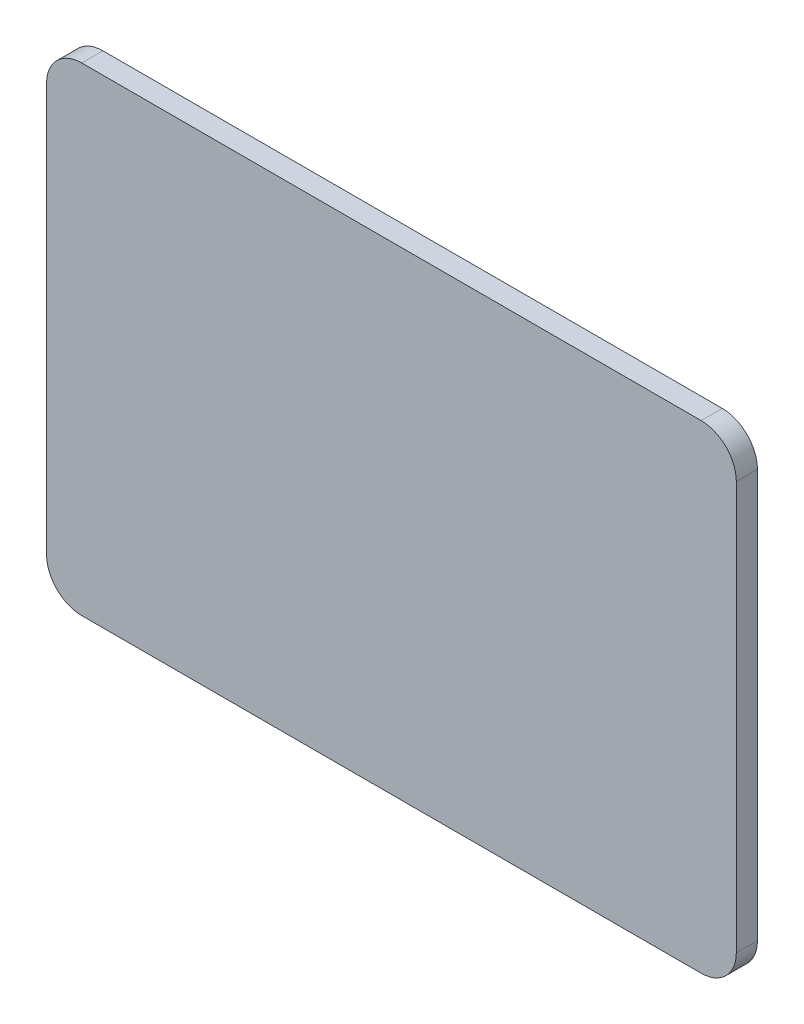
ISO-10303-21;
HEADER;
FILE_DESCRIPTION(('STEP AP214'),'2;1');
FILE_NAME('part.step','',(''),(''),'','','');
FILE_SCHEMA(('AUTOMOTIVE_DESIGN { 1 0 10303 214 1 1 1 1 }'));
ENDSEC;
DATA;
#1=APPLICATION_CONTEXT('core data for automotive mechanical design processes');
#2=APPLICATION_PROTOCOL_DEFINITION('international standard','automotive_design',2000,#1);
#3=PRODUCT_CONTEXT('',#1,'mechanical');
#4=PRODUCT('Part','Part','',(#3));
#5=PRODUCT_RELATED_PRODUCT_CATEGORY('part','',(#4));
#6=PRODUCT_DEFINITION_FORMATION('','',#4);
#7=PRODUCT_DEFINITION_CONTEXT('part definition',#1,'design');
#8=PRODUCT_DEFINITION('design','',#6,#7);
#9=PRODUCT_DEFINITION_SHAPE('','',#8);
#10=(LENGTH_UNIT() NAMED_UNIT(*) SI_UNIT(.MILLI.,.METRE.));
#11=(NAMED_UNIT(*) PLANE_ANGLE_UNIT() SI_UNIT($,.RADIAN.));
#12=(NAMED_UNIT(*) SI_UNIT($,.STERADIAN.) SOLID_ANGLE_UNIT());
#13=UNCERTAINTY_MEASURE_WITH_UNIT(LENGTH_MEASURE(1.E-05),#10,'distance_accuracy_value','');
#14=(GEOMETRIC_REPRESENTATION_CONTEXT(3) GLOBAL_UNCERTAINTY_ASSIGNED_CONTEXT((#13)) GLOBAL_UNIT_ASSIGNED_CONTEXT((#10,
#11,#12)) REPRESENTATION_CONTEXT('',''));
#15=CARTESIAN_POINT('',(0.,0.,0.));
#16=DIRECTION('',(0.,0.,1.));
#17=DIRECTION('',(1.,0.,0.));
#18=AXIS2_PLACEMENT_3D('',#15,#16,#17);
#19=CARTESIAN_POINT('',(111.76,73.66,7.62));
#20=DIRECTION('',(0.,0.,-1.));
#21=DIRECTION('',(-1.,0.,0.));
#22=AXIS2_PLACEMENT_3D('',#19,#20,#21);
#23=CYLINDRICAL_SURFACE('',#22,12.7);
#24=CARTESIAN_POINT('',(111.76,73.66,0.));
#25=DIRECTION('',(0.,0.,1.));
#26=DIRECTION('',(-1.,0.,0.));
#27=AXIS2_PLACEMENT_3D('',#24,#25,#26);
#28=CIRCLE('',#27,12.7);
#29=CARTESIAN_POINT('',(124.46,73.6599999999999,0.));
#30=VERTEX_POINT('',#29);
#31=CARTESIAN_POINT('',(111.76,86.36,0.));
#32=VERTEX_POINT('',#31);
#33=EDGE_CURVE('E132',#30,#32,#28,.T.);
#34=ORIENTED_EDGE('',*,*,#33,.T.);
#35=DIRECTION('',(0.,0.,-1.));
#36=VECTOR('',#35,1.);
#37=CARTESIAN_POINT('',(111.76,86.36,7.62));
#38=LINE('',#37,#36);
#39=CARTESIAN_POINT('',(111.76,86.36,7.62));
#40=VERTEX_POINT('',#39);
#41=EDGE_CURVE('E11',#40,#32,#38,.T.);
#42=ORIENTED_EDGE('',*,*,#41,.F.);
#43=CARTESIAN_POINT('',(111.76,73.66,7.62));
#44=DIRECTION('',(0.,0.,1.));
#45=DIRECTION('',(-1.,0.,0.));
#46=AXIS2_PLACEMENT_3D('',#43,#44,#45);
#47=CIRCLE('',#46,12.7);
#48=CARTESIAN_POINT('',(124.46,73.6599999999999,7.62));
#49=VERTEX_POINT('',#48);
#50=EDGE_CURVE('E146',#49,#40,#47,.T.);
#51=ORIENTED_EDGE('',*,*,#50,.F.);
#52=DIRECTION('',(0.,0.,-1.));
#53=VECTOR('',#52,1.);
#54=CARTESIAN_POINT('',(124.46,73.6599999999999,7.62));
#55=LINE('',#54,#53);
#56=EDGE_CURVE('E128',#49,#30,#55,.T.);
#57=ORIENTED_EDGE('',*,*,#56,.T.);
#58=EDGE_LOOP('',(#34,#42,#51,#57));
#59=FACE_BOUND('',#58,.T.);
#60=ADVANCED_FACE('F36',(#59),#23,.T.);
#61=CARTESIAN_POINT('',(-111.76,86.36,7.62));
#62=DIRECTION('',(0.,-1.,0.));
#63=DIRECTION('',(0.,0.,-1.));
#64=AXIS2_PLACEMENT_3D('',#61,#62,#63);
#65=PLANE('',#64);
#66=DIRECTION('',(-1.,0.,0.));
#67=VECTOR('',#66,1.);
#68=CARTESIAN_POINT('',(-111.76,86.36,0.));
#69=LINE('',#68,#67);
#70=CARTESIAN_POINT('',(-111.76,86.36,0.));
#71=VERTEX_POINT('',#70);
#72=EDGE_CURVE('E135',#32,#71,#69,.T.);
#73=ORIENTED_EDGE('',*,*,#72,.T.);
#74=DIRECTION('',(0.,0.,-1.));
#75=VECTOR('',#74,1.);
#76=CARTESIAN_POINT('',(-111.76,86.36,7.62));
#77=LINE('',#76,#75);
#78=CARTESIAN_POINT('',(-111.76,86.36,7.62));
#79=VERTEX_POINT('',#78);
#80=EDGE_CURVE('E44',#79,#71,#77,.T.);
#81=ORIENTED_EDGE('',*,*,#80,.F.);
#82=DIRECTION('',(-1.,0.,0.));
#83=VECTOR('',#82,1.);
#84=CARTESIAN_POINT('',(-111.76,86.36,7.62));
#85=LINE('',#84,#83);
#86=EDGE_CURVE('E95',#40,#79,#85,.T.);
#87=ORIENTED_EDGE('',*,*,#86,.F.);
#88=ORIENTED_EDGE('',*,*,#41,.T.);
#89=EDGE_LOOP('',(#73,#81,#87,#88));
#90=FACE_BOUND('',#89,.T.);
#91=ADVANCED_FACE('F181',(#90),#65,.F.);
#92=CARTESIAN_POINT('',(-111.76,73.66,7.62));
#93=DIRECTION('',(0.,0.,-1.));
#94=DIRECTION('',(-1.,0.,0.));
#95=AXIS2_PLACEMENT_3D('',#92,#93,#94);
#96=CYLINDRICAL_SURFACE('',#95,12.7);
#97=CARTESIAN_POINT('',(-111.76,73.66,0.));
#98=DIRECTION('',(0.,0.,1.));
#99=DIRECTION('',(-1.,0.,0.));
#100=AXIS2_PLACEMENT_3D('',#97,#98,#99);
#101=CIRCLE('',#100,12.7);
#102=CARTESIAN_POINT('',(-124.46,73.6599999999999,0.));
#103=VERTEX_POINT('',#102);
#104=EDGE_CURVE('E137',#71,#103,#101,.T.);
#105=ORIENTED_EDGE('',*,*,#104,.T.);
#106=DIRECTION('',(0.,0.,-1.));
#107=VECTOR('',#106,1.);
#108=CARTESIAN_POINT('',(-124.46,73.6599999999999,7.62));
#109=LINE('',#108,#107);
#110=CARTESIAN_POINT('',(-124.46,73.6599999999999,7.62));
#111=VERTEX_POINT('',#110);
#112=EDGE_CURVE('E153',#111,#103,#109,.T.);
#113=ORIENTED_EDGE('',*,*,#112,.F.);
#114=CARTESIAN_POINT('',(-111.76,73.66,7.62));
#115=DIRECTION('',(0.,0.,1.));
#116=DIRECTION('',(-1.,0.,0.));
#117=AXIS2_PLACEMENT_3D('',#114,#115,#116);
#118=CIRCLE('',#117,12.7);
#119=EDGE_CURVE('E161',#79,#111,#118,.T.);
#120=ORIENTED_EDGE('',*,*,#119,.F.);
#121=ORIENTED_EDGE('',*,*,#80,.T.);
#122=EDGE_LOOP('',(#105,#113,#120,#121));
#123=FACE_BOUND('',#122,.T.);
#124=ADVANCED_FACE('F159',(#123),#96,.T.);
#125=CARTESIAN_POINT('',(-124.46,-73.6599999999999,7.62));
#126=DIRECTION('',(1.,0.,0.));
#127=DIRECTION('',(0.,0.,-1.));
#128=AXIS2_PLACEMENT_3D('',#125,#126,#127);
#129=PLANE('',#128);
#130=DIRECTION('',(0.,-1.,0.));
#131=VECTOR('',#130,1.);
#132=CARTESIAN_POINT('',(-124.46,-73.6599999999999,0.));
#133=LINE('',#132,#131);
#134=CARTESIAN_POINT('',(-124.46,-73.6599999999999,0.));
#135=VERTEX_POINT('',#134);
#136=EDGE_CURVE('E139',#103,#135,#133,.T.);
#137=ORIENTED_EDGE('',*,*,#136,.T.);
#138=DIRECTION('',(0.,0.,-1.));
#139=VECTOR('',#138,1.);
#140=CARTESIAN_POINT('',(-124.46,-73.6599999999999,7.62));
#141=LINE('',#140,#139);
#142=CARTESIAN_POINT('',(-124.46,-73.6599999999999,7.62));
#143=VERTEX_POINT('',#142);
#144=EDGE_CURVE('E150',#143,#135,#141,.T.);
#145=ORIENTED_EDGE('',*,*,#144,.F.);
#146=DIRECTION('',(0.,-1.,0.));
#147=VECTOR('',#146,1.);
#148=CARTESIAN_POINT('',(-124.46,-73.6599999999999,7.62));
#149=LINE('',#148,#147);
#150=EDGE_CURVE('E173',#111,#143,#149,.T.);
#151=ORIENTED_EDGE('',*,*,#150,.F.);
#152=ORIENTED_EDGE('',*,*,#112,.T.);
#153=EDGE_LOOP('',(#137,#145,#151,#152));
#154=FACE_BOUND('',#153,.T.);
#155=ADVANCED_FACE('F169',(#154),#129,.F.);
#156=CARTESIAN_POINT('',(-111.76,-73.66,7.62));
#157=DIRECTION('',(0.,0.,-1.));
#158=DIRECTION('',(-1.,0.,0.));
#159=AXIS2_PLACEMENT_3D('',#156,#157,#158);
#160=CYLINDRICAL_SURFACE('',#159,12.7);
#161=CARTESIAN_POINT('',(-111.76,-73.66,0.));
#162=DIRECTION('',(0.,0.,1.));
#163=DIRECTION('',(-1.,0.,0.));
#164=AXIS2_PLACEMENT_3D('',#161,#162,#163);
#165=CIRCLE('',#164,12.7);
#166=CARTESIAN_POINT('',(-111.76,-86.36,0.));
#167=VERTEX_POINT('',#166);
#168=EDGE_CURVE('E141',#135,#167,#165,.T.);
#169=ORIENTED_EDGE('',*,*,#168,.T.);
#170=DIRECTION('',(0.,0.,-1.));
#171=VECTOR('',#170,1.);
#172=CARTESIAN_POINT('',(-111.76,-86.36,7.62));
#173=LINE('',#172,#171);
#174=CARTESIAN_POINT('',(-111.76,-86.36,7.62));
#175=VERTEX_POINT('',#174);
#176=EDGE_CURVE('E123',#175,#167,#173,.T.);
#177=ORIENTED_EDGE('',*,*,#176,.F.);
#178=CARTESIAN_POINT('',(-111.76,-73.66,7.62));
#179=DIRECTION('',(0.,0.,1.));
#180=DIRECTION('',(-1.,0.,0.));
#181=AXIS2_PLACEMENT_3D('',#178,#179,#180);
#182=CIRCLE('',#181,12.7);
#183=EDGE_CURVE('E114',#143,#175,#182,.T.);
#184=ORIENTED_EDGE('',*,*,#183,.F.);
#185=ORIENTED_EDGE('',*,*,#144,.T.);
#186=EDGE_LOOP('',(#169,#177,#184,#185));
#187=FACE_BOUND('',#186,.T.);
#188=ADVANCED_FACE('F172',(#187),#160,.T.);
#189=CARTESIAN_POINT('',(-111.76,-86.36,7.62));
#190=DIRECTION('',(0.,1.,0.));
#191=DIRECTION('',(0.,0.,1.));
#192=AXIS2_PLACEMENT_3D('',#189,#190,#191);
#193=PLANE('',#192);
#194=DIRECTION('',(1.,0.,0.));
#195=VECTOR('',#194,1.);
#196=CARTESIAN_POINT('',(-111.76,-86.36,0.));
#197=LINE('',#196,#195);
#198=CARTESIAN_POINT('',(111.76,-86.36,0.));
#199=VERTEX_POINT('',#198);
#200=EDGE_CURVE('E122',#167,#199,#197,.T.);
#201=ORIENTED_EDGE('',*,*,#200,.T.);
#202=DIRECTION('',(0.,0.,-1.));
#203=VECTOR('',#202,1.);
#204=CARTESIAN_POINT('',(111.76,-86.36,7.62));
#205=LINE('',#204,#203);
#206=CARTESIAN_POINT('',(111.76,-86.36,7.62));
#207=VERTEX_POINT('',#206);
#208=EDGE_CURVE('E119',#207,#199,#205,.T.);
#209=ORIENTED_EDGE('',*,*,#208,.F.);
#210=DIRECTION('',(1.,0.,0.));
#211=VECTOR('',#210,1.);
#212=CARTESIAN_POINT('',(-111.76,-86.36,7.62));
#213=LINE('',#212,#211);
#214=EDGE_CURVE('E108',#175,#207,#213,.T.);
#215=ORIENTED_EDGE('',*,*,#214,.F.);
#216=ORIENTED_EDGE('',*,*,#176,.T.);
#217=EDGE_LOOP('',(#201,#209,#215,#216));
#218=FACE_BOUND('',#217,.T.);
#219=ADVANCED_FACE('F120',(#218),#193,.F.);
#220=CARTESIAN_POINT('',(111.76,-73.66,7.62));
#221=DIRECTION('',(0.,0.,-1.));
#222=DIRECTION('',(-1.,0.,0.));
#223=AXIS2_PLACEMENT_3D('',#220,#221,#222);
#224=CYLINDRICAL_SURFACE('',#223,12.7);
#225=CARTESIAN_POINT('',(111.76,-73.66,0.));
#226=DIRECTION('',(0.,0.,1.));
#227=DIRECTION('',(1.,0.,0.));
#228=AXIS2_PLACEMENT_3D('',#225,#226,#227);
#229=CIRCLE('',#228,12.7);
#230=CARTESIAN_POINT('',(124.46,-73.66,0.));
#231=VERTEX_POINT('',#230);
#232=EDGE_CURVE('E81',#199,#231,#229,.T.);
#233=ORIENTED_EDGE('',*,*,#232,.T.);
#234=DIRECTION('',(0.,0.,-1.));
#235=VECTOR('',#234,1.);
#236=CARTESIAN_POINT('',(124.46,-73.66,7.62));
#237=LINE('',#236,#235);
#238=CARTESIAN_POINT('',(124.46,-73.66,7.62));
#239=VERTEX_POINT('',#238);
#240=EDGE_CURVE('E124',#239,#231,#237,.T.);
#241=ORIENTED_EDGE('',*,*,#240,.F.);
#242=CARTESIAN_POINT('',(111.76,-73.66,7.62));
#243=DIRECTION('',(0.,0.,1.));
#244=DIRECTION('',(1.,0.,0.));
#245=AXIS2_PLACEMENT_3D('',#242,#243,#244);
#246=CIRCLE('',#245,12.7);
#247=EDGE_CURVE('E112',#207,#239,#246,.T.);
#248=ORIENTED_EDGE('',*,*,#247,.F.);
#249=ORIENTED_EDGE('',*,*,#208,.T.);
#250=EDGE_LOOP('',(#233,#241,#248,#249));
#251=FACE_BOUND('',#250,.T.);
#252=ADVANCED_FACE('F126',(#251),#224,.T.);
#253=CARTESIAN_POINT('',(124.46,-73.6599999999999,7.62));
#254=DIRECTION('',(-1.,0.,0.));
#255=DIRECTION('',(0.,0.,1.));
#256=AXIS2_PLACEMENT_3D('',#253,#254,#255);
#257=PLANE('',#256);
#258=DIRECTION('',(0.,1.,0.));
#259=VECTOR('',#258,1.);
#260=CARTESIAN_POINT('',(124.46,-73.6599999999999,0.));
#261=LINE('',#260,#259);
#262=EDGE_CURVE('E87',#231,#30,#261,.T.);
#263=ORIENTED_EDGE('',*,*,#262,.T.);
#264=ORIENTED_EDGE('',*,*,#56,.F.);
#265=DIRECTION('',(0.,1.,0.));
#266=VECTOR('',#265,1.);
#267=CARTESIAN_POINT('',(124.46,-73.6599999999999,7.62));
#268=LINE('',#267,#266);
#269=EDGE_CURVE('E52',#239,#49,#268,.T.);
#270=ORIENTED_EDGE('',*,*,#269,.F.);
#271=ORIENTED_EDGE('',*,*,#240,.T.);
#272=EDGE_LOOP('',(#263,#264,#270,#271));
#273=FACE_BOUND('',#272,.T.);
#274=ADVANCED_FACE('F197',(#273),#257,.F.);
#275=CARTESIAN_POINT('',(111.76,73.66,7.62));
#276=DIRECTION('',(0.,0.,-1.));
#277=DIRECTION('',(-1.,0.,0.));
#278=AXIS2_PLACEMENT_3D('',#275,#276,#277);
#279=PLANE('',#278);
#280=ORIENTED_EDGE('',*,*,#50,.T.);
#281=ORIENTED_EDGE('',*,*,#86,.T.);
#282=ORIENTED_EDGE('',*,*,#119,.T.);
#283=ORIENTED_EDGE('',*,*,#150,.T.);
#284=ORIENTED_EDGE('',*,*,#183,.T.);
#285=ORIENTED_EDGE('',*,*,#214,.T.);
#286=ORIENTED_EDGE('',*,*,#247,.T.);
#287=ORIENTED_EDGE('',*,*,#269,.T.);
#288=EDGE_LOOP('',(#280,#281,#282,#283,#284,#285,#286,#287));
#289=FACE_BOUND('',#288,.T.);
#290=ADVANCED_FACE('F110',(#289),#279,.F.);
#291=CARTESIAN_POINT('',(111.76,73.66,0.));
#292=DIRECTION('',(0.,0.,-1.));
#293=DIRECTION('',(-1.,0.,0.));
#294=AXIS2_PLACEMENT_3D('',#291,#292,#293);
#295=PLANE('',#294);
#296=ORIENTED_EDGE('',*,*,#33,.F.);
#297=ORIENTED_EDGE('',*,*,#262,.F.);
#298=ORIENTED_EDGE('',*,*,#232,.F.);
#299=ORIENTED_EDGE('',*,*,#200,.F.);
#300=ORIENTED_EDGE('',*,*,#168,.F.);
#301=ORIENTED_EDGE('',*,*,#136,.F.);
#302=ORIENTED_EDGE('',*,*,#104,.F.);
#303=ORIENTED_EDGE('',*,*,#72,.F.);
#304=EDGE_LOOP('',(#296,#297,#298,#299,#300,#301,#302,#303));
#305=FACE_BOUND('',#304,.T.);
#306=ADVANCED_FACE('F165',(#305),#295,.T.);
#307=CLOSED_SHELL('',(#60,#91,#124,#155,#188,#219,#252,#274,#290,#306));
#308=MANIFOLD_SOLID_BREP('B2',#307);
#309=ADVANCED_BREP_SHAPE_REPRESENTATION('',(#18,#308),#14);
#310=SHAPE_DEFINITION_REPRESENTATION(#9,#309);
ENDSEC;
END-ISO-10303-21;
